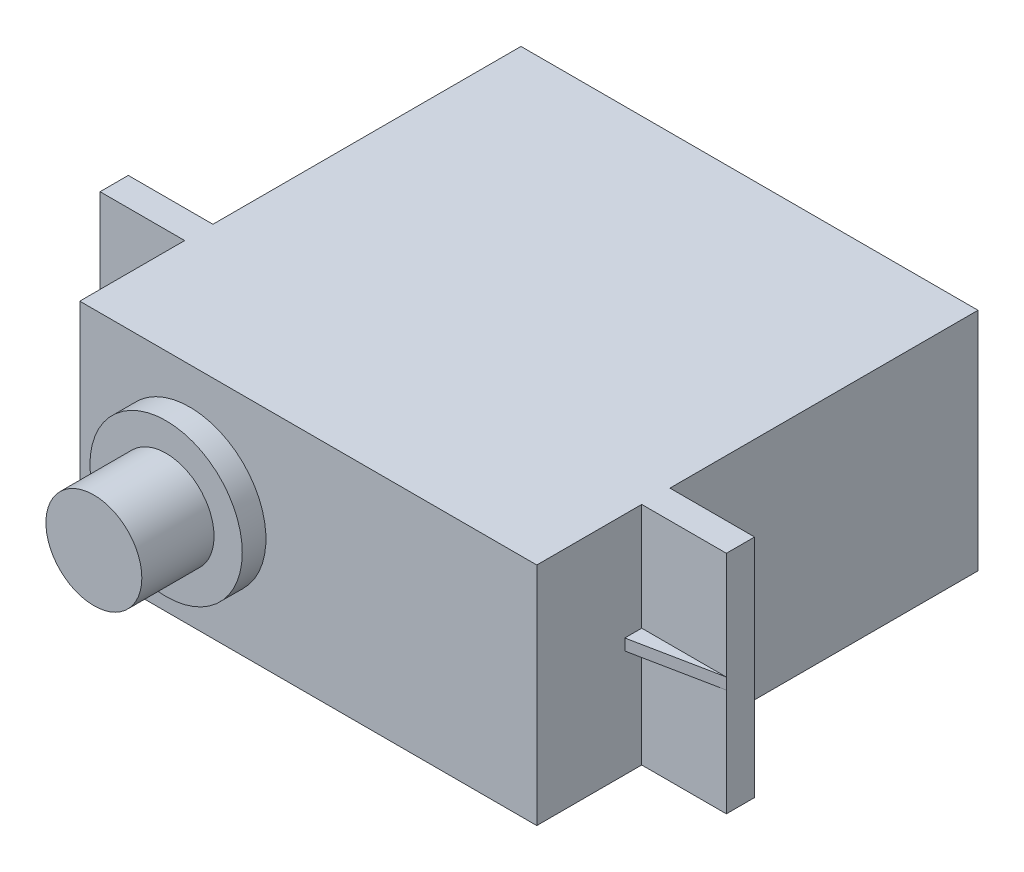
ISO-10303-21;
HEADER;
FILE_DESCRIPTION(('STEP AP214'),'2;1');
FILE_NAME('part.step','',(''),(''),'','','');
FILE_SCHEMA(('AUTOMOTIVE_DESIGN { 1 0 10303 214 1 1 1 1 }'));
ENDSEC;
DATA;
#1=APPLICATION_CONTEXT('core data for automotive mechanical design processes');
#2=APPLICATION_PROTOCOL_DEFINITION('international standard','automotive_design',2000,#1);
#3=PRODUCT_CONTEXT('',#1,'mechanical');
#4=PRODUCT('Part','Part','',(#3));
#5=PRODUCT_RELATED_PRODUCT_CATEGORY('part','',(#4));
#6=PRODUCT_DEFINITION_FORMATION('','',#4);
#7=PRODUCT_DEFINITION_CONTEXT('part definition',#1,'design');
#8=PRODUCT_DEFINITION('design','',#6,#7);
#9=PRODUCT_DEFINITION_SHAPE('','',#8);
#10=(LENGTH_UNIT() NAMED_UNIT(*) SI_UNIT(.MILLI.,.METRE.));
#11=(NAMED_UNIT(*) PLANE_ANGLE_UNIT() SI_UNIT($,.RADIAN.));
#12=(NAMED_UNIT(*) SI_UNIT($,.STERADIAN.) SOLID_ANGLE_UNIT());
#13=UNCERTAINTY_MEASURE_WITH_UNIT(LENGTH_MEASURE(1.E-05),#10,'distance_accuracy_value','');
#14=(GEOMETRIC_REPRESENTATION_CONTEXT(3) GLOBAL_UNCERTAINTY_ASSIGNED_CONTEXT((#13)) GLOBAL_UNIT_ASSIGNED_CONTEXT((#10,
#11,#12)) REPRESENTATION_CONTEXT('',''));
#15=CARTESIAN_POINT('',(0.,0.,0.));
#16=DIRECTION('',(0.,0.,1.));
#17=DIRECTION('',(1.,0.,0.));
#18=AXIS2_PLACEMENT_3D('',#15,#16,#17);
#19=CARTESIAN_POINT('',(0.,0.,31.3));
#20=DIRECTION('',(0.196116135138189,0.,-0.980580675690919));
#21=DIRECTION('',(0.,-1.,0.));
#22=AXIS2_PLACEMENT_3D('',#19,#20,#21);
#23=PLANE('',#22);
#24=DIRECTION('',(0.98058067569092,0.,0.196116135138186));
#25=VECTOR('',#24,1.);
#26=CARTESIAN_POINT('',(-7.5,10.5,29.8));
#27=LINE('',#26,#25);
#28=CARTESIAN_POINT('',(-7.5,10.5,29.8));
#29=VERTEX_POINT('',#28);
#30=CARTESIAN_POINT('',(0.,10.5,31.3));
#31=VERTEX_POINT('',#30);
#32=EDGE_CURVE('E170',#29,#31,#27,.T.);
#33=ORIENTED_EDGE('',*,*,#32,.F.);
#34=DIRECTION('',(0.,-1.,0.));
#35=VECTOR('',#34,1.);
#36=CARTESIAN_POINT('',(-7.5,20.,29.8));
#37=LINE('',#36,#35);
#38=CARTESIAN_POINT('',(-7.5,9.5,29.8));
#39=VERTEX_POINT('',#38);
#40=EDGE_CURVE('E181',#29,#39,#37,.T.);
#41=ORIENTED_EDGE('',*,*,#40,.T.);
#42=DIRECTION('',(0.98058067569092,0.,0.196116135138186));
#43=VECTOR('',#42,1.);
#44=CARTESIAN_POINT('',(-7.5,9.5,29.8));
#45=LINE('',#44,#43);
#46=CARTESIAN_POINT('',(0.,9.5,31.3));
#47=VERTEX_POINT('',#46);
#48=EDGE_CURVE('E180',#39,#47,#45,.T.);
#49=ORIENTED_EDGE('',*,*,#48,.T.);
#50=DIRECTION('',(0.,-1.,0.));
#51=VECTOR('',#50,1.);
#52=CARTESIAN_POINT('',(0.,0.,31.3));
#53=LINE('',#52,#51);
#54=EDGE_CURVE('E11',#31,#47,#53,.T.);
#55=ORIENTED_EDGE('',*,*,#54,.F.);
#56=EDGE_LOOP('',(#33,#41,#49,#55));
#57=FACE_BOUND('',#56,.T.);
#58=ADVANCED_FACE('F39',(#57),#23,.F.);
#59=CARTESIAN_POINT('',(0.,0.,39.1));
#60=DIRECTION('',(0.,1.,0.));
#61=DIRECTION('',(0.,0.,1.));
#62=AXIS2_PLACEMENT_3D('',#59,#60,#61);
#63=PLANE('',#62);
#64=DIRECTION('',(0.,0.,-1.));
#65=VECTOR('',#64,1.);
#66=CARTESIAN_POINT('',(0.,0.,39.1));
#67=LINE('',#66,#65);
#68=CARTESIAN_POINT('',(0.,0.,39.1));
#69=VERTEX_POINT('',#68);
#70=CARTESIAN_POINT('',(0.,0.,29.8));
#71=VERTEX_POINT('',#70);
#72=EDGE_CURVE('E310',#69,#71,#67,.T.);
#73=ORIENTED_EDGE('',*,*,#72,.T.);
#74=DIRECTION('',(-1.,0.,0.));
#75=VECTOR('',#74,1.);
#76=CARTESIAN_POINT('',(-7.5,0.,29.8));
#77=LINE('',#76,#75);
#78=CARTESIAN_POINT('',(-7.5,0.,29.8));
#79=VERTEX_POINT('',#78);
#80=EDGE_CURVE('E187',#71,#79,#77,.T.);
#81=ORIENTED_EDGE('',*,*,#80,.T.);
#82=DIRECTION('',(0.,0.,-1.));
#83=VECTOR('',#82,1.);
#84=CARTESIAN_POINT('',(-7.5,0.,27.3));
#85=LINE('',#84,#83);
#86=CARTESIAN_POINT('',(-7.5,0.,27.3));
#87=VERTEX_POINT('',#86);
#88=EDGE_CURVE('E206',#79,#87,#85,.T.);
#89=ORIENTED_EDGE('',*,*,#88,.T.);
#90=DIRECTION('',(1.,0.,0.));
#91=VECTOR('',#90,1.);
#92=CARTESIAN_POINT('',(-7.5,0.,27.3));
#93=LINE('',#92,#91);
#94=CARTESIAN_POINT('',(0.,0.,27.3));
#95=VERTEX_POINT('',#94);
#96=EDGE_CURVE('E218',#87,#95,#93,.T.);
#97=ORIENTED_EDGE('',*,*,#96,.T.);
#98=CARTESIAN_POINT('',(0.,0.,0.));
#99=VERTEX_POINT('',#98);
#100=EDGE_CURVE('E309',#95,#99,#67,.T.);
#101=ORIENTED_EDGE('',*,*,#100,.T.);
#102=DIRECTION('',(1.,0.,0.));
#103=VECTOR('',#102,1.);
#104=CARTESIAN_POINT('',(0.,0.,0.));
#105=LINE('',#104,#103);
#106=CARTESIAN_POINT('',(40.5,0.,0.));
#107=VERTEX_POINT('',#106);
#108=EDGE_CURVE('E293',#99,#107,#105,.T.);
#109=ORIENTED_EDGE('',*,*,#108,.T.);
#110=DIRECTION('',(0.,0.,-1.));
#111=VECTOR('',#110,1.);
#112=CARTESIAN_POINT('',(40.5,0.,39.1));
#113=LINE('',#112,#111);
#114=CARTESIAN_POINT('',(40.5,0.,27.3));
#115=VERTEX_POINT('',#114);
#116=EDGE_CURVE('E306',#115,#107,#113,.T.);
#117=ORIENTED_EDGE('',*,*,#116,.F.);
#118=DIRECTION('',(-1.,0.,0.));
#119=VECTOR('',#118,1.);
#120=CARTESIAN_POINT('',(48.,0.,27.3));
#121=LINE('',#120,#119);
#122=CARTESIAN_POINT('',(48.,0.,27.3));
#123=VERTEX_POINT('',#122);
#124=EDGE_CURVE('E261',#123,#115,#121,.T.);
#125=ORIENTED_EDGE('',*,*,#124,.F.);
#126=DIRECTION('',(0.,0.,-1.));
#127=VECTOR('',#126,1.);
#128=CARTESIAN_POINT('',(48.,0.,27.3));
#129=LINE('',#128,#127);
#130=CARTESIAN_POINT('',(48.,0.,29.8));
#131=VERTEX_POINT('',#130);
#132=EDGE_CURVE('E259',#131,#123,#129,.T.);
#133=ORIENTED_EDGE('',*,*,#132,.F.);
#134=DIRECTION('',(1.,0.,0.));
#135=VECTOR('',#134,1.);
#136=CARTESIAN_POINT('',(48.,0.,29.8));
#137=LINE('',#136,#135);
#138=CARTESIAN_POINT('',(40.5,0.,29.8));
#139=VERTEX_POINT('',#138);
#140=EDGE_CURVE('E231',#139,#131,#137,.T.);
#141=ORIENTED_EDGE('',*,*,#140,.F.);
#142=CARTESIAN_POINT('',(40.5,0.,39.1));
#143=VERTEX_POINT('',#142);
#144=EDGE_CURVE('E307',#143,#139,#113,.T.);
#145=ORIENTED_EDGE('',*,*,#144,.F.);
#146=DIRECTION('',(1.,0.,0.));
#147=VECTOR('',#146,1.);
#148=CARTESIAN_POINT('',(0.,0.,39.1));
#149=LINE('',#148,#147);
#150=EDGE_CURVE('E283',#69,#143,#149,.T.);
#151=ORIENTED_EDGE('',*,*,#150,.F.);
#152=EDGE_LOOP('',(#73,#81,#89,#97,#101,#109,#117,#125,#133,#141,#145,#151));
#153=FACE_BOUND('',#152,.T.);
#154=ADVANCED_FACE('F347',(#153),#63,.F.);
#155=CARTESIAN_POINT('',(0.,0.,39.1));
#156=DIRECTION('',(1.,0.,0.));
#157=DIRECTION('',(0.,0.,-1.));
#158=AXIS2_PLACEMENT_3D('',#155,#156,#157);
#159=PLANE('',#158);
#160=ORIENTED_EDGE('',*,*,#100,.F.);
#161=DIRECTION('',(0.,1.,0.));
#162=VECTOR('',#161,1.);
#163=CARTESIAN_POINT('',(0.,20.,27.3));
#164=LINE('',#163,#162);
#165=CARTESIAN_POINT('',(0.,20.,27.3));
#166=VERTEX_POINT('',#165);
#167=EDGE_CURVE('E201',#95,#166,#164,.T.);
#168=ORIENTED_EDGE('',*,*,#167,.T.);
#169=DIRECTION('',(0.,0.,-1.));
#170=VECTOR('',#169,1.);
#171=CARTESIAN_POINT('',(0.,20.,39.1));
#172=LINE('',#171,#170);
#173=CARTESIAN_POINT('',(0.,20.,0.));
#174=VERTEX_POINT('',#173);
#175=EDGE_CURVE('E290',#166,#174,#172,.T.);
#176=ORIENTED_EDGE('',*,*,#175,.T.);
#177=DIRECTION('',(0.,-1.,0.));
#178=VECTOR('',#177,1.);
#179=CARTESIAN_POINT('',(0.,0.,0.));
#180=LINE('',#179,#178);
#181=EDGE_CURVE('E279',#174,#99,#180,.T.);
#182=ORIENTED_EDGE('',*,*,#181,.T.);
#183=EDGE_LOOP('',(#160,#168,#176,#182));
#184=FACE_BOUND('',#183,.T.);
#185=ADVANCED_FACE('F351',(#184),#159,.F.);
#186=CARTESIAN_POINT('',(47.9999999999999,20.,29.8));
#187=DIRECTION('',(0.196116135138188,0.,0.980580675690919));
#188=DIRECTION('',(0.,1.,0.));
#189=AXIS2_PLACEMENT_3D('',#186,#187,#188);
#190=PLANE('',#189);
#191=DIRECTION('',(-0.98058067569092,0.,0.196116135138186));
#192=VECTOR('',#191,1.);
#193=CARTESIAN_POINT('',(48.,10.5,29.8));
#194=LINE('',#193,#192);
#195=CARTESIAN_POINT('',(48.,10.5,29.8));
#196=VERTEX_POINT('',#195);
#197=CARTESIAN_POINT('',(40.5,10.5,31.3));
#198=VERTEX_POINT('',#197);
#199=EDGE_CURVE('E60',#196,#198,#194,.T.);
#200=ORIENTED_EDGE('',*,*,#199,.T.);
#201=DIRECTION('',(0.,1.,0.));
#202=VECTOR('',#201,1.);
#203=CARTESIAN_POINT('',(40.5,20.,31.3));
#204=LINE('',#203,#202);
#205=CARTESIAN_POINT('',(40.5,9.5,31.3));
#206=VERTEX_POINT('',#205);
#207=EDGE_CURVE('E47',#206,#198,#204,.T.);
#208=ORIENTED_EDGE('',*,*,#207,.F.);
#209=DIRECTION('',(-0.98058067569092,0.,0.196116135138186));
#210=VECTOR('',#209,1.);
#211=CARTESIAN_POINT('',(48.,9.5,29.8));
#212=LINE('',#211,#210);
#213=CARTESIAN_POINT('',(48.,9.5,29.8));
#214=VERTEX_POINT('',#213);
#215=EDGE_CURVE('E232',#214,#206,#212,.T.);
#216=ORIENTED_EDGE('',*,*,#215,.F.);
#217=DIRECTION('',(0.,-1.,0.));
#218=VECTOR('',#217,1.);
#219=CARTESIAN_POINT('',(48.,20.,29.8));
#220=LINE('',#219,#218);
#221=EDGE_CURVE('E255',#196,#214,#220,.T.);
#222=ORIENTED_EDGE('',*,*,#221,.F.);
#223=EDGE_LOOP('',(#200,#208,#216,#222));
#224=FACE_BOUND('',#223,.T.);
#225=ADVANCED_FACE('F320',(#224),#190,.T.);
#226=CARTESIAN_POINT('',(0.,20.,39.1));
#227=DIRECTION('',(0.,-1.,0.));
#228=DIRECTION('',(0.,0.,-1.));
#229=AXIS2_PLACEMENT_3D('',#226,#227,#228);
#230=PLANE('',#229);
#231=DIRECTION('',(0.,0.,1.));
#232=VECTOR('',#231,1.);
#233=CARTESIAN_POINT('',(-7.5,20.,27.3));
#234=LINE('',#233,#232);
#235=CARTESIAN_POINT('',(-7.5,20.,27.3));
#236=VERTEX_POINT('',#235);
#237=CARTESIAN_POINT('',(-7.5,20.,29.8));
#238=VERTEX_POINT('',#237);
#239=EDGE_CURVE('E211',#236,#238,#234,.T.);
#240=ORIENTED_EDGE('',*,*,#239,.T.);
#241=DIRECTION('',(-1.,0.,0.));
#242=VECTOR('',#241,1.);
#243=CARTESIAN_POINT('',(-7.5,20.,29.8));
#244=LINE('',#243,#242);
#245=CARTESIAN_POINT('',(0.,20.,29.8));
#246=VERTEX_POINT('',#245);
#247=EDGE_CURVE('E176',#246,#238,#244,.T.);
#248=ORIENTED_EDGE('',*,*,#247,.F.);
#249=CARTESIAN_POINT('',(0.,20.,39.1));
#250=VERTEX_POINT('',#249);
#251=EDGE_CURVE('E301',#250,#246,#172,.T.);
#252=ORIENTED_EDGE('',*,*,#251,.F.);
#253=DIRECTION('',(-1.,0.,0.));
#254=VECTOR('',#253,1.);
#255=CARTESIAN_POINT('',(0.,20.,39.1));
#256=LINE('',#255,#254);
#257=CARTESIAN_POINT('',(40.5,20.,39.1));
#258=VERTEX_POINT('',#257);
#259=EDGE_CURVE('E288',#258,#250,#256,.T.);
#260=ORIENTED_EDGE('',*,*,#259,.F.);
#261=DIRECTION('',(0.,0.,-1.));
#262=VECTOR('',#261,1.);
#263=CARTESIAN_POINT('',(40.5,20.,39.1));
#264=LINE('',#263,#262);
#265=CARTESIAN_POINT('',(40.5,20.,29.8));
#266=VERTEX_POINT('',#265);
#267=EDGE_CURVE('E304',#258,#266,#264,.T.);
#268=ORIENTED_EDGE('',*,*,#267,.T.);
#269=DIRECTION('',(1.,0.,0.));
#270=VECTOR('',#269,1.);
#271=CARTESIAN_POINT('',(48.,20.,29.8));
#272=LINE('',#271,#270);
#273=CARTESIAN_POINT('',(48.,20.,29.8));
#274=VERTEX_POINT('',#273);
#275=EDGE_CURVE('E220',#266,#274,#272,.T.);
#276=ORIENTED_EDGE('',*,*,#275,.T.);
#277=DIRECTION('',(0.,0.,1.));
#278=VECTOR('',#277,1.);
#279=CARTESIAN_POINT('',(48.,20.,27.3));
#280=LINE('',#279,#278);
#281=CARTESIAN_POINT('',(48.,20.,27.3));
#282=VERTEX_POINT('',#281);
#283=EDGE_CURVE('E252',#282,#274,#280,.T.);
#284=ORIENTED_EDGE('',*,*,#283,.F.);
#285=DIRECTION('',(-1.,0.,0.));
#286=VECTOR('',#285,1.);
#287=CARTESIAN_POINT('',(48.,20.,27.3));
#288=LINE('',#287,#286);
#289=CARTESIAN_POINT('',(40.5,20.,27.3));
#290=VERTEX_POINT('',#289);
#291=EDGE_CURVE('E266',#282,#290,#288,.T.);
#292=ORIENTED_EDGE('',*,*,#291,.T.);
#293=CARTESIAN_POINT('',(40.5,20.,0.));
#294=VERTEX_POINT('',#293);
#295=EDGE_CURVE('E303',#290,#294,#264,.T.);
#296=ORIENTED_EDGE('',*,*,#295,.T.);
#297=DIRECTION('',(-1.,0.,0.));
#298=VECTOR('',#297,1.);
#299=CARTESIAN_POINT('',(0.,20.,0.));
#300=LINE('',#299,#298);
#301=EDGE_CURVE('E284',#294,#174,#300,.T.);
#302=ORIENTED_EDGE('',*,*,#301,.T.);
#303=ORIENTED_EDGE('',*,*,#175,.F.);
#304=DIRECTION('',(1.,0.,0.));
#305=VECTOR('',#304,1.);
#306=CARTESIAN_POINT('',(-7.5,20.,27.3));
#307=LINE('',#306,#305);
#308=EDGE_CURVE('E214',#236,#166,#307,.T.);
#309=ORIENTED_EDGE('',*,*,#308,.F.);
#310=EDGE_LOOP('',(#240,#248,#252,#260,#268,#276,#284,#292,#296,#302,#303,#309));
#311=FACE_BOUND('',#310,.T.);
#312=ADVANCED_FACE('F328',(#311),#230,.F.);
#313=CARTESIAN_POINT('',(40.5,0.,39.1));
#314=DIRECTION('',(-1.,0.,0.));
#315=DIRECTION('',(0.,0.,1.));
#316=AXIS2_PLACEMENT_3D('',#313,#314,#315);
#317=PLANE('',#316);
#318=DIRECTION('',(0.,1.,0.));
#319=VECTOR('',#318,1.);
#320=CARTESIAN_POINT('',(40.5,20.,27.3));
#321=LINE('',#320,#319);
#322=EDGE_CURVE('E246',#115,#290,#321,.T.);
#323=ORIENTED_EDGE('',*,*,#322,.F.);
#324=ORIENTED_EDGE('',*,*,#116,.T.);
#325=DIRECTION('',(0.,1.,0.));
#326=VECTOR('',#325,1.);
#327=CARTESIAN_POINT('',(40.5,0.,0.));
#328=LINE('',#327,#326);
#329=EDGE_CURVE('E296',#107,#294,#328,.T.);
#330=ORIENTED_EDGE('',*,*,#329,.T.);
#331=ORIENTED_EDGE('',*,*,#295,.F.);
#332=EDGE_LOOP('',(#323,#324,#330,#331));
#333=FACE_BOUND('',#332,.T.);
#334=ADVANCED_FACE('F360',(#333),#317,.F.);
#335=ORIENTED_EDGE('',*,*,#144,.T.);
#336=DIRECTION('',(0.,-1.,0.));
#337=VECTOR('',#336,1.);
#338=CARTESIAN_POINT('',(40.5,9.5,29.8));
#339=LINE('',#338,#337);
#340=CARTESIAN_POINT('',(40.5,9.5,29.8));
#341=VERTEX_POINT('',#340);
#342=EDGE_CURVE('E241',#341,#139,#339,.T.);
#343=ORIENTED_EDGE('',*,*,#342,.F.);
#344=DIRECTION('',(0.,0.,-1.));
#345=VECTOR('',#344,1.);
#346=CARTESIAN_POINT('',(40.5,9.5,31.3));
#347=LINE('',#346,#345);
#348=EDGE_CURVE('E235',#206,#341,#347,.T.);
#349=ORIENTED_EDGE('',*,*,#348,.F.);
#350=ORIENTED_EDGE('',*,*,#207,.T.);
#351=DIRECTION('',(0.,0.,-1.));
#352=VECTOR('',#351,1.);
#353=CARTESIAN_POINT('',(40.5,10.5,31.3));
#354=LINE('',#353,#352);
#355=CARTESIAN_POINT('',(40.5,10.5,29.8));
#356=VERTEX_POINT('',#355);
#357=EDGE_CURVE('E224',#198,#356,#354,.T.);
#358=ORIENTED_EDGE('',*,*,#357,.T.);
#359=DIRECTION('',(0.,1.,0.));
#360=VECTOR('',#359,1.);
#361=CARTESIAN_POINT('',(40.5,10.5,29.8));
#362=LINE('',#361,#360);
#363=EDGE_CURVE('E226',#356,#266,#362,.T.);
#364=ORIENTED_EDGE('',*,*,#363,.T.);
#365=ORIENTED_EDGE('',*,*,#267,.F.);
#366=DIRECTION('',(0.,1.,0.));
#367=VECTOR('',#366,1.);
#368=CARTESIAN_POINT('',(40.5,0.,39.1));
#369=LINE('',#368,#367);
#370=EDGE_CURVE('E286',#143,#258,#369,.T.);
#371=ORIENTED_EDGE('',*,*,#370,.F.);
#372=EDGE_LOOP('',(#335,#343,#349,#350,#358,#364,#365,#371));
#373=FACE_BOUND('',#372,.T.);
#374=ADVANCED_FACE('F316',(#373),#317,.F.);
#375=ORIENTED_EDGE('',*,*,#251,.T.);
#376=DIRECTION('',(0.,1.,0.));
#377=VECTOR('',#376,1.);
#378=CARTESIAN_POINT('',(0.,10.5,29.8));
#379=LINE('',#378,#377);
#380=CARTESIAN_POINT('',(0.,10.5,29.8));
#381=VERTEX_POINT('',#380);
#382=EDGE_CURVE('E165',#381,#246,#379,.T.);
#383=ORIENTED_EDGE('',*,*,#382,.F.);
#384=DIRECTION('',(0.,0.,-1.));
#385=VECTOR('',#384,1.);
#386=CARTESIAN_POINT('',(0.,10.5,31.3));
#387=LINE('',#386,#385);
#388=EDGE_CURVE('E161',#31,#381,#387,.T.);
#389=ORIENTED_EDGE('',*,*,#388,.F.);
#390=ORIENTED_EDGE('',*,*,#54,.T.);
#391=DIRECTION('',(0.,0.,-1.));
#392=VECTOR('',#391,1.);
#393=CARTESIAN_POINT('',(0.,9.5,31.3));
#394=LINE('',#393,#392);
#395=CARTESIAN_POINT('',(0.,9.5,29.8));
#396=VERTEX_POINT('',#395);
#397=EDGE_CURVE('E189',#47,#396,#394,.T.);
#398=ORIENTED_EDGE('',*,*,#397,.T.);
#399=DIRECTION('',(0.,-1.,0.));
#400=VECTOR('',#399,1.);
#401=CARTESIAN_POINT('',(0.,9.5,29.8));
#402=LINE('',#401,#400);
#403=EDGE_CURVE('E198',#396,#71,#402,.T.);
#404=ORIENTED_EDGE('',*,*,#403,.T.);
#405=ORIENTED_EDGE('',*,*,#72,.F.);
#406=DIRECTION('',(0.,-1.,0.));
#407=VECTOR('',#406,1.);
#408=CARTESIAN_POINT('',(0.,0.,39.1));
#409=LINE('',#408,#407);
#410=EDGE_CURVE('E280',#250,#69,#409,.T.);
#411=ORIENTED_EDGE('',*,*,#410,.F.);
#412=EDGE_LOOP('',(#375,#383,#389,#390,#398,#404,#405,#411));
#413=FACE_BOUND('',#412,.T.);
#414=ADVANCED_FACE('F163',(#413),#159,.F.);
#415=CARTESIAN_POINT('',(0.,0.,39.1));
#416=DIRECTION('',(0.,0.,-1.));
#417=DIRECTION('',(-1.,0.,0.));
#418=AXIS2_PLACEMENT_3D('',#415,#416,#417);
#419=PLANE('',#418);
#420=CARTESIAN_POINT('',(9.75,10.,39.1));
#421=DIRECTION('',(0.,0.,-1.));
#422=DIRECTION('',(-1.,0.,0.));
#423=AXIS2_PLACEMENT_3D('',#420,#421,#422);
#424=CIRCLE('',#423,6.75);
#425=CARTESIAN_POINT('',(3.,10.,39.1));
#426=VERTEX_POINT('',#425);
#427=EDGE_CURVE('E276',#426,#426,#424,.F.);
#428=ORIENTED_EDGE('',*,*,#427,.F.);
#429=EDGE_LOOP('',(#428));
#430=FACE_BOUND('',#429,.T.);
#431=ORIENTED_EDGE('',*,*,#410,.T.);
#432=ORIENTED_EDGE('',*,*,#150,.T.);
#433=ORIENTED_EDGE('',*,*,#370,.T.);
#434=ORIENTED_EDGE('',*,*,#259,.T.);
#435=EDGE_LOOP('',(#431,#432,#433,#434));
#436=FACE_BOUND('',#435,.T.);
#437=ADVANCED_FACE('F363',(#430,#436),#419,.F.);
#438=CARTESIAN_POINT('',(0.,0.,0.));
#439=DIRECTION('',(0.,0.,-1.));
#440=DIRECTION('',(-1.,0.,0.));
#441=AXIS2_PLACEMENT_3D('',#438,#439,#440);
#442=PLANE('',#441);
#443=ORIENTED_EDGE('',*,*,#181,.F.);
#444=ORIENTED_EDGE('',*,*,#301,.F.);
#445=ORIENTED_EDGE('',*,*,#329,.F.);
#446=ORIENTED_EDGE('',*,*,#108,.F.);
#447=EDGE_LOOP('',(#443,#444,#445,#446));
#448=FACE_BOUND('',#447,.T.);
#449=ADVANCED_FACE('F376',(#448),#442,.T.);
#450=CARTESIAN_POINT('',(9.75,10.,41.2));
#451=DIRECTION('',(0.,0.,-1.));
#452=DIRECTION('',(-1.,0.,0.));
#453=AXIS2_PLACEMENT_3D('',#450,#451,#452);
#454=CYLINDRICAL_SURFACE('',#453,6.75);
#455=CARTESIAN_POINT('',(9.75,10.,41.2));
#456=DIRECTION('',(0.,0.,1.));
#457=DIRECTION('',(1.,0.,0.));
#458=AXIS2_PLACEMENT_3D('',#455,#456,#457);
#459=CIRCLE('',#458,6.75);
#460=CARTESIAN_POINT('',(16.5,10.,41.2));
#461=VERTEX_POINT('',#460);
#462=EDGE_CURVE('E272',#461,#461,#459,.T.);
#463=ORIENTED_EDGE('',*,*,#462,.F.);
#464=EDGE_LOOP('',(#463));
#465=FACE_BOUND('',#464,.T.);
#466=ORIENTED_EDGE('',*,*,#427,.T.);
#467=EDGE_LOOP('',(#466));
#468=FACE_BOUND('',#467,.T.);
#469=ADVANCED_FACE('F379',(#465,#468),#454,.T.);
#470=CARTESIAN_POINT('',(9.75,10.,41.2));
#471=DIRECTION('',(0.,0.,1.));
#472=DIRECTION('',(1.,0.,0.));
#473=AXIS2_PLACEMENT_3D('',#470,#471,#472);
#474=PLANE('',#473);
#475=CARTESIAN_POINT('',(9.75,10.,41.2));
#476=DIRECTION('',(0.,0.,1.));
#477=DIRECTION('',(1.,0.,0.));
#478=AXIS2_PLACEMENT_3D('',#475,#476,#477);
#479=CIRCLE('',#478,4.25);
#480=CARTESIAN_POINT('',(14.,10.,41.2));
#481=VERTEX_POINT('',#480);
#482=EDGE_CURVE('E273',#481,#481,#479,.T.);
#483=ORIENTED_EDGE('',*,*,#482,.F.);
#484=EDGE_LOOP('',(#483));
#485=FACE_BOUND('',#484,.T.);
#486=ORIENTED_EDGE('',*,*,#462,.T.);
#487=EDGE_LOOP('',(#486));
#488=FACE_BOUND('',#487,.T.);
#489=ADVANCED_FACE('F386',(#485,#488),#474,.T.);
#490=CARTESIAN_POINT('',(9.75,10.,47.6));
#491=DIRECTION('',(0.,0.,-1.));
#492=DIRECTION('',(-1.,0.,0.));
#493=AXIS2_PLACEMENT_3D('',#490,#491,#492);
#494=CYLINDRICAL_SURFACE('',#493,4.25);
#495=CARTESIAN_POINT('',(9.75,10.,47.6));
#496=DIRECTION('',(0.,0.,1.));
#497=DIRECTION('',(1.,0.,0.));
#498=AXIS2_PLACEMENT_3D('',#495,#496,#497);
#499=CIRCLE('',#498,4.25);
#500=CARTESIAN_POINT('',(14.,10.,47.6));
#501=VERTEX_POINT('',#500);
#502=EDGE_CURVE('E269',#501,#501,#499,.T.);
#503=ORIENTED_EDGE('',*,*,#502,.F.);
#504=EDGE_LOOP('',(#503));
#505=FACE_BOUND('',#504,.T.);
#506=ORIENTED_EDGE('',*,*,#482,.T.);
#507=EDGE_LOOP('',(#506));
#508=FACE_BOUND('',#507,.T.);
#509=ADVANCED_FACE('F390',(#505,#508),#494,.T.);
#510=CARTESIAN_POINT('',(9.75,10.,47.6));
#511=DIRECTION('',(0.,0.,1.));
#512=DIRECTION('',(1.,0.,0.));
#513=AXIS2_PLACEMENT_3D('',#510,#511,#512);
#514=PLANE('',#513);
#515=ORIENTED_EDGE('',*,*,#502,.T.);
#516=EDGE_LOOP('',(#515));
#517=FACE_BOUND('',#516,.T.);
#518=ADVANCED_FACE('F394',(#517),#514,.T.);
#519=CARTESIAN_POINT('',(48.,20.,27.3));
#520=DIRECTION('',(0.,0.,1.));
#521=DIRECTION('',(0.,-1.,0.));
#522=AXIS2_PLACEMENT_3D('',#519,#520,#521);
#523=PLANE('',#522);
#524=ORIENTED_EDGE('',*,*,#322,.T.);
#525=ORIENTED_EDGE('',*,*,#291,.F.);
#526=DIRECTION('',(0.,1.,0.));
#527=VECTOR('',#526,1.);
#528=CARTESIAN_POINT('',(48.,20.,27.3));
#529=LINE('',#528,#527);
#530=EDGE_CURVE('E249',#123,#282,#529,.T.);
#531=ORIENTED_EDGE('',*,*,#530,.F.);
#532=ORIENTED_EDGE('',*,*,#124,.T.);
#533=EDGE_LOOP('',(#524,#525,#531,#532));
#534=FACE_BOUND('',#533,.T.);
#535=ADVANCED_FACE('F398',(#534),#523,.F.);
#536=CARTESIAN_POINT('',(48.,0.,0.));
#537=DIRECTION('',(-1.,0.,0.));
#538=DIRECTION('',(0.,0.,1.));
#539=AXIS2_PLACEMENT_3D('',#536,#537,#538);
#540=PLANE('',#539);
#541=ORIENTED_EDGE('',*,*,#530,.T.);
#542=ORIENTED_EDGE('',*,*,#283,.T.);
#543=EDGE_CURVE('E256',#274,#196,#220,.T.);
#544=ORIENTED_EDGE('',*,*,#543,.T.);
#545=ORIENTED_EDGE('',*,*,#221,.T.);
#546=DIRECTION('',(0.,-1.,0.));
#547=VECTOR('',#546,1.);
#548=CARTESIAN_POINT('',(48.,9.5,29.8));
#549=LINE('',#548,#547);
#550=EDGE_CURVE('E243',#214,#131,#549,.T.);
#551=ORIENTED_EDGE('',*,*,#550,.T.);
#552=ORIENTED_EDGE('',*,*,#132,.T.);
#553=EDGE_LOOP('',(#541,#542,#544,#545,#551,#552));
#554=FACE_BOUND('',#553,.T.);
#555=ADVANCED_FACE('F323',(#554),#540,.F.);
#556=CARTESIAN_POINT('',(48.,9.5,29.8));
#557=DIRECTION('',(0.,0.,-1.));
#558=DIRECTION('',(-1.,0.,0.));
#559=AXIS2_PLACEMENT_3D('',#556,#557,#558);
#560=PLANE('',#559);
#561=ORIENTED_EDGE('',*,*,#140,.T.);
#562=ORIENTED_EDGE('',*,*,#550,.F.);
#563=DIRECTION('',(1.,0.,0.));
#564=VECTOR('',#563,1.);
#565=CARTESIAN_POINT('',(48.,9.5,29.8));
#566=LINE('',#565,#564);
#567=EDGE_CURVE('E238',#341,#214,#566,.T.);
#568=ORIENTED_EDGE('',*,*,#567,.F.);
#569=ORIENTED_EDGE('',*,*,#342,.T.);
#570=EDGE_LOOP('',(#561,#562,#568,#569));
#571=FACE_BOUND('',#570,.T.);
#572=ADVANCED_FACE('F405',(#571),#560,.F.);
#573=CARTESIAN_POINT('',(0.,9.5,0.));
#574=DIRECTION('',(0.,-1.,0.));
#575=DIRECTION('',(0.,0.,-1.));
#576=AXIS2_PLACEMENT_3D('',#573,#574,#575);
#577=PLANE('',#576);
#578=ORIENTED_EDGE('',*,*,#215,.T.);
#579=ORIENTED_EDGE('',*,*,#348,.T.);
#580=ORIENTED_EDGE('',*,*,#567,.T.);
#581=EDGE_LOOP('',(#578,#579,#580));
#582=FACE_BOUND('',#581,.T.);
#583=ADVANCED_FACE('F344',(#582),#577,.T.);
#584=CARTESIAN_POINT('',(48.,10.5,29.8));
#585=DIRECTION('',(0.,0.,1.));
#586=DIRECTION('',(1.,0.,0.));
#587=AXIS2_PLACEMENT_3D('',#584,#585,#586);
#588=PLANE('',#587);
#589=ORIENTED_EDGE('',*,*,#275,.F.);
#590=ORIENTED_EDGE('',*,*,#363,.F.);
#591=DIRECTION('',(1.,0.,0.));
#592=VECTOR('',#591,1.);
#593=CARTESIAN_POINT('',(48.,10.5,29.8));
#594=LINE('',#593,#592);
#595=EDGE_CURVE('E222',#356,#196,#594,.T.);
#596=ORIENTED_EDGE('',*,*,#595,.T.);
#597=ORIENTED_EDGE('',*,*,#543,.F.);
#598=EDGE_LOOP('',(#589,#590,#596,#597));
#599=FACE_BOUND('',#598,.T.);
#600=ADVANCED_FACE('F326',(#599),#588,.T.);
#601=CARTESIAN_POINT('',(0.,10.5,0.));
#602=DIRECTION('',(0.,1.,0.));
#603=DIRECTION('',(0.,0.,-1.));
#604=AXIS2_PLACEMENT_3D('',#601,#602,#603);
#605=PLANE('',#604);
#606=ORIENTED_EDGE('',*,*,#199,.F.);
#607=ORIENTED_EDGE('',*,*,#595,.F.);
#608=ORIENTED_EDGE('',*,*,#357,.F.);
#609=EDGE_LOOP('',(#606,#607,#608));
#610=FACE_BOUND('',#609,.T.);
#611=ADVANCED_FACE('F333',(#610),#605,.T.);
#612=CARTESIAN_POINT('',(-7.5,20.,27.3));
#613=DIRECTION('',(0.,0.,-1.));
#614=DIRECTION('',(0.,1.,0.));
#615=AXIS2_PLACEMENT_3D('',#612,#613,#614);
#616=PLANE('',#615);
#617=ORIENTED_EDGE('',*,*,#167,.F.);
#618=ORIENTED_EDGE('',*,*,#96,.F.);
#619=DIRECTION('',(0.,1.,0.));
#620=VECTOR('',#619,1.);
#621=CARTESIAN_POINT('',(-7.5,20.,27.3));
#622=LINE('',#621,#620);
#623=EDGE_CURVE('E203',#87,#236,#622,.T.);
#624=ORIENTED_EDGE('',*,*,#623,.T.);
#625=ORIENTED_EDGE('',*,*,#308,.T.);
#626=EDGE_LOOP('',(#617,#618,#624,#625));
#627=FACE_BOUND('',#626,.T.);
#628=ADVANCED_FACE('F335',(#627),#616,.T.);
#629=CARTESIAN_POINT('',(-7.5,0.,0.));
#630=DIRECTION('',(1.,0.,0.));
#631=DIRECTION('',(0.,0.,1.));
#632=AXIS2_PLACEMENT_3D('',#629,#630,#631);
#633=PLANE('',#632);
#634=ORIENTED_EDGE('',*,*,#623,.F.);
#635=ORIENTED_EDGE('',*,*,#88,.F.);
#636=DIRECTION('',(0.,-1.,0.));
#637=VECTOR('',#636,1.);
#638=CARTESIAN_POINT('',(-7.5,9.5,29.8));
#639=LINE('',#638,#637);
#640=EDGE_CURVE('E196',#39,#79,#639,.T.);
#641=ORIENTED_EDGE('',*,*,#640,.F.);
#642=ORIENTED_EDGE('',*,*,#40,.F.);
#643=EDGE_CURVE('E209',#238,#29,#37,.T.);
#644=ORIENTED_EDGE('',*,*,#643,.F.);
#645=ORIENTED_EDGE('',*,*,#239,.F.);
#646=EDGE_LOOP('',(#634,#635,#641,#642,#644,#645));
#647=FACE_BOUND('',#646,.T.);
#648=ADVANCED_FACE('F341',(#647),#633,.F.);
#649=CARTESIAN_POINT('',(-7.5,9.5,29.8));
#650=DIRECTION('',(0.,0.,1.));
#651=DIRECTION('',(1.,0.,0.));
#652=AXIS2_PLACEMENT_3D('',#649,#650,#651);
#653=PLANE('',#652);
#654=ORIENTED_EDGE('',*,*,#80,.F.);
#655=ORIENTED_EDGE('',*,*,#403,.F.);
#656=DIRECTION('',(-1.,0.,0.));
#657=VECTOR('',#656,1.);
#658=CARTESIAN_POINT('',(-7.5,9.5,29.8));
#659=LINE('',#658,#657);
#660=EDGE_CURVE('E186',#396,#39,#659,.T.);
#661=ORIENTED_EDGE('',*,*,#660,.T.);
#662=ORIENTED_EDGE('',*,*,#640,.T.);
#663=EDGE_LOOP('',(#654,#655,#661,#662));
#664=FACE_BOUND('',#663,.T.);
#665=ADVANCED_FACE('F444',(#664),#653,.T.);
#666=CARTESIAN_POINT('',(40.5,9.5,0.));
#667=DIRECTION('',(0.,-1.,0.));
#668=DIRECTION('',(0.,0.,-1.));
#669=AXIS2_PLACEMENT_3D('',#666,#667,#668);
#670=PLANE('',#669);
#671=ORIENTED_EDGE('',*,*,#48,.F.);
#672=ORIENTED_EDGE('',*,*,#660,.F.);
#673=ORIENTED_EDGE('',*,*,#397,.F.);
#674=EDGE_LOOP('',(#671,#672,#673));
#675=FACE_BOUND('',#674,.T.);
#676=ADVANCED_FACE('F445',(#675),#670,.T.);
#677=CARTESIAN_POINT('',(-7.5,10.5,29.8));
#678=DIRECTION('',(0.,0.,-1.));
#679=DIRECTION('',(-1.,0.,0.));
#680=AXIS2_PLACEMENT_3D('',#677,#678,#679);
#681=PLANE('',#680);
#682=ORIENTED_EDGE('',*,*,#247,.T.);
#683=ORIENTED_EDGE('',*,*,#643,.T.);
#684=DIRECTION('',(-1.,0.,0.));
#685=VECTOR('',#684,1.);
#686=CARTESIAN_POINT('',(-7.5,10.5,29.8));
#687=LINE('',#686,#685);
#688=EDGE_CURVE('E169',#381,#29,#687,.T.);
#689=ORIENTED_EDGE('',*,*,#688,.F.);
#690=ORIENTED_EDGE('',*,*,#382,.T.);
#691=EDGE_LOOP('',(#682,#683,#689,#690));
#692=FACE_BOUND('',#691,.T.);
#693=ADVANCED_FACE('F436',(#692),#681,.F.);
#694=CARTESIAN_POINT('',(40.5,10.5,0.));
#695=DIRECTION('',(0.,1.,0.));
#696=DIRECTION('',(0.,0.,-1.));
#697=AXIS2_PLACEMENT_3D('',#694,#695,#696);
#698=PLANE('',#697);
#699=ORIENTED_EDGE('',*,*,#32,.T.);
#700=ORIENTED_EDGE('',*,*,#388,.T.);
#701=ORIENTED_EDGE('',*,*,#688,.T.);
#702=EDGE_LOOP('',(#699,#700,#701));
#703=FACE_BOUND('',#702,.T.);
#704=ADVANCED_FACE('F173',(#703),#698,.T.);
#705=CLOSED_SHELL('',(#58,#154,#185,#225,#312,#334,#374,#414,#437,#449,#469,#489,#509,#518,#535,
#555,#572,#583,#600,#611,#628,#648,#665,#676,#693,#704));
#706=MANIFOLD_SOLID_BREP('B2',#705);
#707=ADVANCED_BREP_SHAPE_REPRESENTATION('',(#18,#706),#14);
#708=SHAPE_DEFINITION_REPRESENTATION(#9,#707);
ENDSEC;
END-ISO-10303-21;
